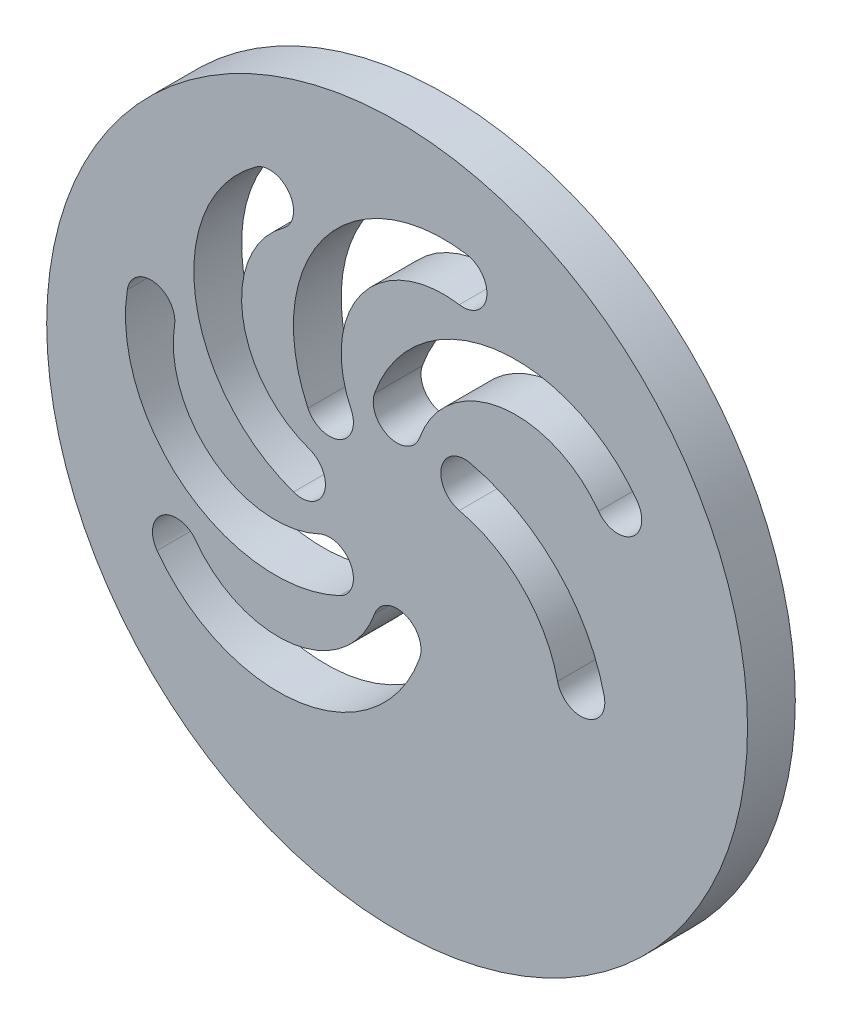
ISO-10303-21;
HEADER;
FILE_DESCRIPTION(('STEP AP214'),'2;1');
FILE_NAME('part.step','',(''),(''),'','','');
FILE_SCHEMA(('AUTOMOTIVE_DESIGN { 1 0 10303 214 1 1 1 1 }'));
ENDSEC;
DATA;
#1=APPLICATION_CONTEXT('core data for automotive mechanical design processes');
#2=APPLICATION_PROTOCOL_DEFINITION('international standard','automotive_design',2000,#1);
#3=PRODUCT_CONTEXT('',#1,'mechanical');
#4=PRODUCT('Part','Part','',(#3));
#5=PRODUCT_RELATED_PRODUCT_CATEGORY('part','',(#4));
#6=PRODUCT_DEFINITION_FORMATION('','',#4);
#7=PRODUCT_DEFINITION_CONTEXT('part definition',#1,'design');
#8=PRODUCT_DEFINITION('design','',#6,#7);
#9=PRODUCT_DEFINITION_SHAPE('','',#8);
#10=(LENGTH_UNIT() NAMED_UNIT(*) SI_UNIT(.MILLI.,.METRE.));
#11=(NAMED_UNIT(*) PLANE_ANGLE_UNIT() SI_UNIT($,.RADIAN.));
#12=(NAMED_UNIT(*) SI_UNIT($,.STERADIAN.) SOLID_ANGLE_UNIT());
#13=UNCERTAINTY_MEASURE_WITH_UNIT(LENGTH_MEASURE(1.E-05),#10,'distance_accuracy_value','');
#14=(GEOMETRIC_REPRESENTATION_CONTEXT(3) GLOBAL_UNCERTAINTY_ASSIGNED_CONTEXT((#13)) GLOBAL_UNIT_ASSIGNED_CONTEXT((#10,
#11,#12)) REPRESENTATION_CONTEXT('',''));
#15=CARTESIAN_POINT('',(0.,0.,0.));
#16=DIRECTION('',(0.,0.,1.));
#17=DIRECTION('',(1.,0.,0.));
#18=AXIS2_PLACEMENT_3D('',#15,#16,#17);
#19=CARTESIAN_POINT('',(0.,0.,4.7625));
#20=DIRECTION('',(0.,0.,1.));
#21=DIRECTION('',(1.,0.,0.));
#22=AXIS2_PLACEMENT_3D('',#19,#20,#21);
#23=PLANE('',#22);
#24=CARTESIAN_POINT('',(0.,0.,4.7625));
#25=DIRECTION('',(0.,0.,1.));
#26=DIRECTION('',(1.,0.,0.));
#27=AXIS2_PLACEMENT_3D('',#24,#25,#26);
#28=CIRCLE('',#27,34.925);
#29=CARTESIAN_POINT('',(34.925,0.,4.7625));
#30=VERTEX_POINT('',#29);
#31=EDGE_CURVE('E11',#30,#30,#28,.T.);
#32=ORIENTED_EDGE('',*,*,#31,.T.);
#33=EDGE_LOOP('',(#32));
#34=FACE_BOUND('',#33,.T.);
#35=CARTESIAN_POINT('',(21.9970452561247,12.7000000000001,4.7625));
#36=DIRECTION('',(0.,0.,1.));
#37=DIRECTION('',(-1.,0.,0.));
#38=AXIS2_PLACEMENT_3D('',#35,#36,#37);
#39=CIRCLE('',#38,2.38125);
#40=CARTESIAN_POINT('',(20.0701413644611,11.3009313973963,4.7625));
#41=VERTEX_POINT('',#40);
#42=CARTESIAN_POINT('',(23.9239491477882,14.099068602604,4.7625));
#43=VERTEX_POINT('',#42);
#44=EDGE_CURVE('E356',#41,#43,#39,.T.);
#45=ORIENTED_EDGE('',*,*,#44,.F.);
#46=CARTESIAN_POINT('',(11.834422394303,5.32121653934507,4.7625));
#47=DIRECTION('',(0.,0.,-1.));
#48=DIRECTION('',(1.,0.,0.));
#49=AXIS2_PLACEMENT_3D('',#46,#47,#48);
#50=CIRCLE('',#49,10.1776252995982);
#51=CARTESIAN_POINT('',(2.24388869657268,8.72793345328424,4.7625));
#52=VERTEX_POINT('',#51);
#53=EDGE_CURVE('E354',#52,#41,#50,.T.);
#54=ORIENTED_EDGE('',*,*,#53,.F.);
#55=CARTESIAN_POINT('',(0.,9.525,4.7625));
#56=DIRECTION('',(0.,0.,1.));
#57=DIRECTION('',(-1.,0.,0.));
#58=AXIS2_PLACEMENT_3D('',#55,#56,#57);
#59=CIRCLE('',#58,2.38125);
#60=CARTESIAN_POINT('',(-2.24388869657267,10.3220665467158,4.7625));
#61=VERTEX_POINT('',#60);
#62=EDGE_CURVE('E362',#61,#52,#59,.T.);
#63=ORIENTED_EDGE('',*,*,#62,.F.);
#64=CARTESIAN_POINT('',(11.834422394303,5.32121653934507,4.7625));
#65=DIRECTION('',(0.,0.,1.));
#66=DIRECTION('',(-1.,0.,0.));
#67=AXIS2_PLACEMENT_3D('',#64,#65,#66);
#68=CIRCLE('',#67,14.9401252995982);
#69=EDGE_CURVE('E359',#43,#61,#68,.T.);
#70=ORIENTED_EDGE('',*,*,#69,.F.);
#71=EDGE_LOOP('',(#45,#54,#63,#70));
#72=FACE_BOUND('',#71,.T.);
#73=CARTESIAN_POINT('',(-21.9970452561247,-12.7000000000001,4.7625));
#74=DIRECTION('',(0.,0.,1.));
#75=DIRECTION('',(-1.,0.,0.));
#76=AXIS2_PLACEMENT_3D('',#73,#74,#75);
#77=CIRCLE('',#76,2.38125);
#78=CARTESIAN_POINT('',(-20.0701413644611,-11.3009313973963,4.7625));
#79=VERTEX_POINT('',#78);
#80=CARTESIAN_POINT('',(-23.9239491477882,-14.099068602604,4.7625));
#81=VERTEX_POINT('',#80);
#82=EDGE_CURVE('E325',#79,#81,#77,.T.);
#83=ORIENTED_EDGE('',*,*,#82,.F.);
#84=CARTESIAN_POINT('',(-11.834422394303,-5.32121653934507,4.7625));
#85=DIRECTION('',(0.,0.,-1.));
#86=DIRECTION('',(1.,0.,0.));
#87=AXIS2_PLACEMENT_3D('',#84,#85,#86);
#88=CIRCLE('',#87,10.1776252995982);
#89=CARTESIAN_POINT('',(-2.24388869657267,-8.72793345328424,4.7625));
#90=VERTEX_POINT('',#89);
#91=EDGE_CURVE('E323',#90,#79,#88,.T.);
#92=ORIENTED_EDGE('',*,*,#91,.F.);
#93=CARTESIAN_POINT('',(0.,-9.525,4.7625));
#94=DIRECTION('',(0.,0.,1.));
#95=DIRECTION('',(-1.,0.,0.));
#96=AXIS2_PLACEMENT_3D('',#93,#94,#95);
#97=CIRCLE('',#96,2.38125);
#98=CARTESIAN_POINT('',(2.24388869657267,-10.3220665467158,4.7625));
#99=VERTEX_POINT('',#98);
#100=EDGE_CURVE('E331',#99,#90,#97,.T.);
#101=ORIENTED_EDGE('',*,*,#100,.F.);
#102=CARTESIAN_POINT('',(-11.834422394303,-5.32121653934507,4.7625));
#103=DIRECTION('',(0.,0.,1.));
#104=DIRECTION('',(-1.,0.,0.));
#105=AXIS2_PLACEMENT_3D('',#102,#103,#104);
#106=CIRCLE('',#105,14.9401252995982);
#107=EDGE_CURVE('E328',#81,#99,#106,.T.);
#108=ORIENTED_EDGE('',*,*,#107,.F.);
#109=EDGE_LOOP('',(#83,#92,#101,#108));
#110=FACE_BOUND('',#109,.T.);
#111=CARTESIAN_POINT('',(18.3186104059108,-4.9084568647241,4.7625));
#112=DIRECTION('',(0.,0.,1.));
#113=DIRECTION('',(1.,0.,0.));
#114=AXIS2_PLACEMENT_3D('',#111,#112,#113);
#115=CIRCLE('',#114,2.38125);
#116=CARTESIAN_POINT('',(15.9953090561529,-5.43058941562764,4.7625));
#117=VERTEX_POINT('',#116);
#118=CARTESIAN_POINT('',(20.6419117556687,-4.38632431382056,4.7625));
#119=VERTEX_POINT('',#118);
#120=EDGE_CURVE('E294',#117,#119,#115,.T.);
#121=ORIENTED_EDGE('',*,*,#120,.F.);
#122=CARTESIAN_POINT('',(3.2767625818453,-8.28892163977387,4.7625));
#123=DIRECTION('',(0.,0.,-1.));
#124=DIRECTION('',(1.,0.,0.));
#125=AXIS2_PLACEMENT_3D('',#122,#123,#124);
#126=CIRCLE('',#125,13.0357772120697);
#127=CARTESIAN_POINT('',(6.20101743086769,4.41462987547902,4.7625));
#128=VERTEX_POINT('',#127);
#129=EDGE_CURVE('E292',#128,#117,#126,.T.);
#130=ORIENTED_EDGE('',*,*,#129,.F.);
#131=CARTESIAN_POINT('',(6.73519209080183,6.7351920908019,4.7625));
#132=DIRECTION('',(0.,0.,1.));
#133=DIRECTION('',(-1.,0.,0.));
#134=AXIS2_PLACEMENT_3D('',#131,#132,#133);
#135=CIRCLE('',#134,2.38125);
#136=CARTESIAN_POINT('',(7.26936675073597,9.05575430612478,4.7625));
#137=VERTEX_POINT('',#136);
#138=EDGE_CURVE('E300',#137,#128,#135,.T.);
#139=ORIENTED_EDGE('',*,*,#138,.F.);
#140=CARTESIAN_POINT('',(3.2767625818453,-8.28892163977387,4.7625));
#141=DIRECTION('',(0.,0.,1.));
#142=DIRECTION('',(-1.,0.,0.));
#143=AXIS2_PLACEMENT_3D('',#140,#141,#142);
#144=CIRCLE('',#143,17.7982772120697);
#145=EDGE_CURVE('E297',#119,#137,#144,.T.);
#146=ORIENTED_EDGE('',*,*,#145,.F.);
#147=EDGE_LOOP('',(#121,#130,#139,#146));
#148=FACE_BOUND('',#147,.T.);
#149=CARTESIAN_POINT('',(-24.5345159877424,6.57400374560391,4.7625));
#150=DIRECTION('',(0.,0.,1.));
#151=DIRECTION('',(-1.,0.,0.));
#152=AXIS2_PLACEMENT_3D('',#149,#150,#151);
#153=CIRCLE('',#152,2.38125);
#154=CARTESIAN_POINT('',(-22.182698283006,6.20076783336024,4.7625));
#155=VERTEX_POINT('',#154);
#156=CARTESIAN_POINT('',(-26.8863336924788,6.94723965784758,4.7625));
#157=VERTEX_POINT('',#156);
#158=EDGE_CURVE('E263',#155,#157,#153,.T.);
#159=ORIENTED_EDGE('',*,*,#158,.F.);
#160=CARTESIAN_POINT('',(-12.1308686255705,4.60553202730468,4.7625));
#161=DIRECTION('',(0.,0.,-1.));
#162=DIRECTION('',(1.,0.,0.));
#163=AXIS2_PLACEMENT_3D('',#160,#161,#162);
#164=CIRCLE('',#163,10.1776252995982);
#165=CARTESIAN_POINT('',(-7.75824984413659,-4.58491201698783,4.7625));
#166=VERTEX_POINT('',#165);
#167=EDGE_CURVE('E261',#166,#155,#164,.T.);
#168=ORIENTED_EDGE('',*,*,#167,.F.);
#169=CARTESIAN_POINT('',(-6.73519209080187,-6.73519209080187,4.7625));
#170=DIRECTION('',(0.,0.,1.));
#171=DIRECTION('',(-1.,0.,0.));
#172=AXIS2_PLACEMENT_3D('',#169,#170,#171);
#173=CIRCLE('',#172,2.38125);
#174=CARTESIAN_POINT('',(-5.71213433746714,-8.88547216461591,4.7625));
#175=VERTEX_POINT('',#174);
#176=EDGE_CURVE('E269',#175,#166,#173,.T.);
#177=ORIENTED_EDGE('',*,*,#176,.F.);
#178=CARTESIAN_POINT('',(-12.1308686255705,4.60553202730468,4.7625));
#179=DIRECTION('',(0.,0.,1.));
#180=DIRECTION('',(-1.,0.,0.));
#181=AXIS2_PLACEMENT_3D('',#178,#179,#180);
#182=CIRCLE('',#181,14.9401252995982);
#183=EDGE_CURVE('E266',#157,#175,#182,.T.);
#184=ORIENTED_EDGE('',*,*,#183,.F.);
#185=EDGE_LOOP('',(#159,#168,#177,#184));
#186=FACE_BOUND('',#185,.T.);
#187=CARTESIAN_POINT('',(-12.7000000000001,21.9970452561247,4.7625));
#188=DIRECTION('',(0.,0.,1.));
#189=DIRECTION('',(-1.,0.,0.));
#190=AXIS2_PLACEMENT_3D('',#187,#188,#189);
#191=CIRCLE('',#190,2.38125);
#192=CARTESIAN_POINT('',(-11.3009313973963,20.0701413644611,4.7625));
#193=VERTEX_POINT('',#192);
#194=CARTESIAN_POINT('',(-14.099068602604,23.9239491477882,4.7625));
#195=VERTEX_POINT('',#194);
#196=EDGE_CURVE('E232',#193,#195,#191,.T.);
#197=ORIENTED_EDGE('',*,*,#196,.F.);
#198=CARTESIAN_POINT('',(-5.32121653934508,11.834422394303,4.7625));
#199=DIRECTION('',(0.,0.,-1.));
#200=DIRECTION('',(1.,0.,0.));
#201=AXIS2_PLACEMENT_3D('',#198,#199,#200);
#202=CIRCLE('',#201,10.1776252995982);
#203=CARTESIAN_POINT('',(-8.72793345328424,2.24388869657267,4.7625));
#204=VERTEX_POINT('',#203);
#205=EDGE_CURVE('E230',#204,#193,#202,.T.);
#206=ORIENTED_EDGE('',*,*,#205,.F.);
#207=CARTESIAN_POINT('',(-9.525,0.,4.7625));
#208=DIRECTION('',(0.,0.,1.));
#209=DIRECTION('',(-1.,0.,0.));
#210=AXIS2_PLACEMENT_3D('',#207,#208,#209);
#211=CIRCLE('',#210,2.38125);
#212=CARTESIAN_POINT('',(-10.3220665467158,-2.24388869657268,4.7625));
#213=VERTEX_POINT('',#212);
#214=EDGE_CURVE('E238',#213,#204,#211,.T.);
#215=ORIENTED_EDGE('',*,*,#214,.F.);
#216=CARTESIAN_POINT('',(-5.32121653934508,11.834422394303,4.7625));
#217=DIRECTION('',(0.,0.,1.));
#218=DIRECTION('',(-1.,0.,0.));
#219=AXIS2_PLACEMENT_3D('',#216,#217,#218);
#220=CIRCLE('',#219,14.9401252995982);
#221=EDGE_CURVE('E235',#195,#213,#220,.T.);
#222=ORIENTED_EDGE('',*,*,#221,.F.);
#223=EDGE_LOOP('',(#197,#206,#215,#222));
#224=FACE_BOUND('',#223,.T.);
#225=CARTESIAN_POINT('',(6.5740037456039,24.5345159877424,4.7625));
#226=DIRECTION('',(0.,0.,1.));
#227=DIRECTION('',(-1.,0.,0.));
#228=AXIS2_PLACEMENT_3D('',#225,#226,#227);
#229=CIRCLE('',#228,2.38125);
#230=CARTESIAN_POINT('',(6.20076783336023,22.182698283006,4.7625));
#231=VERTEX_POINT('',#230);
#232=CARTESIAN_POINT('',(6.94723965784757,26.8863336924788,4.7625));
#233=VERTEX_POINT('',#232);
#234=EDGE_CURVE('E202',#231,#233,#229,.T.);
#235=ORIENTED_EDGE('',*,*,#234,.F.);
#236=CARTESIAN_POINT('',(4.60553202730468,12.1308686255705,4.7625));
#237=DIRECTION('',(0.,0.,-1.));
#238=DIRECTION('',(1.,0.,0.));
#239=AXIS2_PLACEMENT_3D('',#236,#237,#238);
#240=CIRCLE('',#239,10.1776252995982);
#241=CARTESIAN_POINT('',(-4.58491201698783,7.75824984413659,4.7625));
#242=VERTEX_POINT('',#241);
#243=EDGE_CURVE('E194',#242,#231,#240,.T.);
#244=ORIENTED_EDGE('',*,*,#243,.F.);
#245=CARTESIAN_POINT('',(-6.73519209080187,6.73519209080186,4.7625));
#246=DIRECTION('',(0.,0.,1.));
#247=DIRECTION('',(-1.,0.,0.));
#248=AXIS2_PLACEMENT_3D('',#245,#246,#247);
#249=CIRCLE('',#248,2.38125);
#250=CARTESIAN_POINT('',(-8.88547216461591,5.71213433746714,4.7625));
#251=VERTEX_POINT('',#250);
#252=EDGE_CURVE('E216',#251,#242,#249,.T.);
#253=ORIENTED_EDGE('',*,*,#252,.F.);
#254=CARTESIAN_POINT('',(4.60553202730468,12.1308686255705,4.7625));
#255=DIRECTION('',(0.,0.,1.));
#256=DIRECTION('',(-1.,0.,0.));
#257=AXIS2_PLACEMENT_3D('',#254,#255,#256);
#258=CIRCLE('',#257,14.9401252995982);
#259=EDGE_CURVE('E214',#233,#251,#258,.T.);
#260=ORIENTED_EDGE('',*,*,#259,.F.);
#261=EDGE_LOOP('',(#235,#244,#253,#260));
#262=FACE_BOUND('',#261,.T.);
#263=ADVANCED_FACE('F33',(#34,#72,#110,#148,#186,#224,#262),#23,.T.);
#264=CARTESIAN_POINT('',(0.,0.,0.));
#265=DIRECTION('',(0.,0.,1.));
#266=DIRECTION('',(1.,0.,0.));
#267=AXIS2_PLACEMENT_3D('',#264,#265,#266);
#268=PLANE('',#267);
#269=CARTESIAN_POINT('',(-5.32121653934508,11.834422394303,0.));
#270=DIRECTION('',(0.,0.,-1.));
#271=DIRECTION('',(1.,0.,0.));
#272=AXIS2_PLACEMENT_3D('',#269,#270,#271);
#273=CIRCLE('',#272,10.1776252995982);
#274=CARTESIAN_POINT('',(-8.72793345328424,2.24388869657267,0.));
#275=VERTEX_POINT('',#274);
#276=CARTESIAN_POINT('',(-11.3009313973963,20.0701413644611,0.));
#277=VERTEX_POINT('',#276);
#278=EDGE_CURVE('E210',#275,#277,#273,.T.);
#279=ORIENTED_EDGE('',*,*,#278,.T.);
#280=CARTESIAN_POINT('',(-12.7000000000001,21.9970452561247,0.));
#281=DIRECTION('',(0.,0.,1.));
#282=DIRECTION('',(-1.,0.,0.));
#283=AXIS2_PLACEMENT_3D('',#280,#281,#282);
#284=CIRCLE('',#283,2.38125);
#285=CARTESIAN_POINT('',(-14.099068602604,23.9239491477882,0.));
#286=VERTEX_POINT('',#285);
#287=EDGE_CURVE('E243',#277,#286,#284,.T.);
#288=ORIENTED_EDGE('',*,*,#287,.T.);
#289=CARTESIAN_POINT('',(-5.32121653934508,11.834422394303,0.));
#290=DIRECTION('',(0.,0.,1.));
#291=DIRECTION('',(-1.,0.,0.));
#292=AXIS2_PLACEMENT_3D('',#289,#290,#291);
#293=CIRCLE('',#292,14.9401252995982);
#294=CARTESIAN_POINT('',(-10.3220665467158,-2.24388869657268,0.));
#295=VERTEX_POINT('',#294);
#296=EDGE_CURVE('E246',#286,#295,#293,.T.);
#297=ORIENTED_EDGE('',*,*,#296,.T.);
#298=CARTESIAN_POINT('',(-9.525,0.,0.));
#299=DIRECTION('',(0.,0.,1.));
#300=DIRECTION('',(-1.,0.,0.));
#301=AXIS2_PLACEMENT_3D('',#298,#299,#300);
#302=CIRCLE('',#301,2.38125);
#303=EDGE_CURVE('E233',#295,#275,#302,.T.);
#304=ORIENTED_EDGE('',*,*,#303,.T.);
#305=EDGE_LOOP('',(#279,#288,#297,#304));
#306=FACE_BOUND('',#305,.T.);
#307=CARTESIAN_POINT('',(3.2767625818453,-8.28892163977387,0.));
#308=DIRECTION('',(0.,0.,-1.));
#309=DIRECTION('',(1.,0.,0.));
#310=AXIS2_PLACEMENT_3D('',#307,#308,#309);
#311=CIRCLE('',#310,13.0357772120697);
#312=CARTESIAN_POINT('',(6.20101743086769,4.41462987547902,0.));
#313=VERTEX_POINT('',#312);
#314=CARTESIAN_POINT('',(15.9953090561529,-5.43058941562764,0.));
#315=VERTEX_POINT('',#314);
#316=EDGE_CURVE('E291',#313,#315,#311,.T.);
#317=ORIENTED_EDGE('',*,*,#316,.T.);
#318=CARTESIAN_POINT('',(18.3186104059108,-4.9084568647241,0.));
#319=DIRECTION('',(0.,0.,1.));
#320=DIRECTION('',(1.,0.,0.));
#321=AXIS2_PLACEMENT_3D('',#318,#319,#320);
#322=CIRCLE('',#321,2.38125);
#323=CARTESIAN_POINT('',(20.6419117556687,-4.38632431382056,0.));
#324=VERTEX_POINT('',#323);
#325=EDGE_CURVE('E305',#315,#324,#322,.T.);
#326=ORIENTED_EDGE('',*,*,#325,.T.);
#327=CARTESIAN_POINT('',(3.2767625818453,-8.28892163977387,0.));
#328=DIRECTION('',(0.,0.,1.));
#329=DIRECTION('',(-1.,0.,0.));
#330=AXIS2_PLACEMENT_3D('',#327,#328,#329);
#331=CIRCLE('',#330,17.7982772120697);
#332=CARTESIAN_POINT('',(7.26936675073597,9.05575430612478,0.));
#333=VERTEX_POINT('',#332);
#334=EDGE_CURVE('E308',#324,#333,#331,.T.);
#335=ORIENTED_EDGE('',*,*,#334,.T.);
#336=CARTESIAN_POINT('',(6.73519209080183,6.7351920908019,0.));
#337=DIRECTION('',(0.,0.,1.));
#338=DIRECTION('',(-1.,0.,0.));
#339=AXIS2_PLACEMENT_3D('',#336,#337,#338);
#340=CIRCLE('',#339,2.38125);
#341=EDGE_CURVE('E295',#333,#313,#340,.T.);
#342=ORIENTED_EDGE('',*,*,#341,.T.);
#343=EDGE_LOOP('',(#317,#326,#335,#342));
#344=FACE_BOUND('',#343,.T.);
#345=CARTESIAN_POINT('',(11.834422394303,5.32121653934507,0.));
#346=DIRECTION('',(0.,0.,-1.));
#347=DIRECTION('',(1.,0.,0.));
#348=AXIS2_PLACEMENT_3D('',#345,#346,#347);
#349=CIRCLE('',#348,10.1776252995982);
#350=CARTESIAN_POINT('',(2.24388869657267,8.72793345328424,0.));
#351=VERTEX_POINT('',#350);
#352=CARTESIAN_POINT('',(20.0701413644611,11.3009313973963,0.));
#353=VERTEX_POINT('',#352);
#354=EDGE_CURVE('E353',#351,#353,#349,.T.);
#355=ORIENTED_EDGE('',*,*,#354,.T.);
#356=CARTESIAN_POINT('',(21.9970452561247,12.7000000000001,0.));
#357=DIRECTION('',(0.,0.,1.));
#358=DIRECTION('',(-1.,0.,0.));
#359=AXIS2_PLACEMENT_3D('',#356,#357,#358);
#360=CIRCLE('',#359,2.38125);
#361=CARTESIAN_POINT('',(23.9239491477882,14.099068602604,0.));
#362=VERTEX_POINT('',#361);
#363=EDGE_CURVE('E367',#353,#362,#360,.T.);
#364=ORIENTED_EDGE('',*,*,#363,.T.);
#365=CARTESIAN_POINT('',(11.834422394303,5.32121653934507,0.));
#366=DIRECTION('',(0.,0.,1.));
#367=DIRECTION('',(-1.,0.,0.));
#368=AXIS2_PLACEMENT_3D('',#365,#366,#367);
#369=CIRCLE('',#368,14.9401252995982);
#370=CARTESIAN_POINT('',(-2.24388869657267,10.3220665467158,0.));
#371=VERTEX_POINT('',#370);
#372=EDGE_CURVE('E370',#362,#371,#369,.T.);
#373=ORIENTED_EDGE('',*,*,#372,.T.);
#374=CARTESIAN_POINT('',(0.,9.525,0.));
#375=DIRECTION('',(0.,0.,1.));
#376=DIRECTION('',(-1.,0.,0.));
#377=AXIS2_PLACEMENT_3D('',#374,#375,#376);
#378=CIRCLE('',#377,2.38125);
#379=EDGE_CURVE('E357',#371,#351,#378,.T.);
#380=ORIENTED_EDGE('',*,*,#379,.T.);
#381=EDGE_LOOP('',(#355,#364,#373,#380));
#382=FACE_BOUND('',#381,.T.);
#383=CARTESIAN_POINT('',(0.,0.,0.));
#384=DIRECTION('',(0.,0.,1.));
#385=DIRECTION('',(1.,0.,0.));
#386=AXIS2_PLACEMENT_3D('',#383,#384,#385);
#387=CIRCLE('',#386,34.925);
#388=CARTESIAN_POINT('',(34.925,0.,0.));
#389=VERTEX_POINT('',#388);
#390=EDGE_CURVE('E37',#389,#389,#387,.T.);
#391=ORIENTED_EDGE('',*,*,#390,.F.);
#392=EDGE_LOOP('',(#391));
#393=FACE_BOUND('',#392,.T.);
#394=CARTESIAN_POINT('',(-11.834422394303,-5.32121653934507,0.));
#395=DIRECTION('',(0.,0.,-1.));
#396=DIRECTION('',(1.,0.,0.));
#397=AXIS2_PLACEMENT_3D('',#394,#395,#396);
#398=CIRCLE('',#397,10.1776252995982);
#399=CARTESIAN_POINT('',(-2.24388869657267,-8.72793345328424,0.));
#400=VERTEX_POINT('',#399);
#401=CARTESIAN_POINT('',(-20.0701413644611,-11.3009313973963,0.));
#402=VERTEX_POINT('',#401);
#403=EDGE_CURVE('E322',#400,#402,#398,.T.);
#404=ORIENTED_EDGE('',*,*,#403,.T.);
#405=CARTESIAN_POINT('',(-21.9970452561247,-12.7000000000001,0.));
#406=DIRECTION('',(0.,0.,1.));
#407=DIRECTION('',(-1.,0.,0.));
#408=AXIS2_PLACEMENT_3D('',#405,#406,#407);
#409=CIRCLE('',#408,2.38125);
#410=CARTESIAN_POINT('',(-23.9239491477882,-14.099068602604,0.));
#411=VERTEX_POINT('',#410);
#412=EDGE_CURVE('E336',#402,#411,#409,.T.);
#413=ORIENTED_EDGE('',*,*,#412,.T.);
#414=CARTESIAN_POINT('',(-11.834422394303,-5.32121653934507,0.));
#415=DIRECTION('',(0.,0.,1.));
#416=DIRECTION('',(-1.,0.,0.));
#417=AXIS2_PLACEMENT_3D('',#414,#415,#416);
#418=CIRCLE('',#417,14.9401252995982);
#419=CARTESIAN_POINT('',(2.24388869657267,-10.3220665467158,0.));
#420=VERTEX_POINT('',#419);
#421=EDGE_CURVE('E339',#411,#420,#418,.T.);
#422=ORIENTED_EDGE('',*,*,#421,.T.);
#423=CARTESIAN_POINT('',(0.,-9.525,0.));
#424=DIRECTION('',(0.,0.,1.));
#425=DIRECTION('',(-1.,0.,0.));
#426=AXIS2_PLACEMENT_3D('',#423,#424,#425);
#427=CIRCLE('',#426,2.38125);
#428=EDGE_CURVE('E326',#420,#400,#427,.T.);
#429=ORIENTED_EDGE('',*,*,#428,.T.);
#430=EDGE_LOOP('',(#404,#413,#422,#429));
#431=FACE_BOUND('',#430,.T.);
#432=CARTESIAN_POINT('',(-12.1308686255705,4.60553202730468,0.));
#433=DIRECTION('',(0.,0.,-1.));
#434=DIRECTION('',(1.,0.,0.));
#435=AXIS2_PLACEMENT_3D('',#432,#433,#434);
#436=CIRCLE('',#435,10.1776252995982);
#437=CARTESIAN_POINT('',(-7.75824984413659,-4.58491201698783,0.));
#438=VERTEX_POINT('',#437);
#439=CARTESIAN_POINT('',(-22.182698283006,6.20076783336024,0.));
#440=VERTEX_POINT('',#439);
#441=EDGE_CURVE('E260',#438,#440,#436,.T.);
#442=ORIENTED_EDGE('',*,*,#441,.T.);
#443=CARTESIAN_POINT('',(-24.5345159877424,6.57400374560391,0.));
#444=DIRECTION('',(0.,0.,1.));
#445=DIRECTION('',(-1.,0.,0.));
#446=AXIS2_PLACEMENT_3D('',#443,#444,#445);
#447=CIRCLE('',#446,2.38125);
#448=CARTESIAN_POINT('',(-26.8863336924788,6.94723965784758,0.));
#449=VERTEX_POINT('',#448);
#450=EDGE_CURVE('E274',#440,#449,#447,.T.);
#451=ORIENTED_EDGE('',*,*,#450,.T.);
#452=CARTESIAN_POINT('',(-12.1308686255705,4.60553202730468,0.));
#453=DIRECTION('',(0.,0.,1.));
#454=DIRECTION('',(-1.,0.,0.));
#455=AXIS2_PLACEMENT_3D('',#452,#453,#454);
#456=CIRCLE('',#455,14.9401252995982);
#457=CARTESIAN_POINT('',(-5.71213433746714,-8.88547216461591,0.));
#458=VERTEX_POINT('',#457);
#459=EDGE_CURVE('E277',#449,#458,#456,.T.);
#460=ORIENTED_EDGE('',*,*,#459,.T.);
#461=CARTESIAN_POINT('',(-6.73519209080187,-6.73519209080187,0.));
#462=DIRECTION('',(0.,0.,1.));
#463=DIRECTION('',(-1.,0.,0.));
#464=AXIS2_PLACEMENT_3D('',#461,#462,#463);
#465=CIRCLE('',#464,2.38125);
#466=EDGE_CURVE('E264',#458,#438,#465,.T.);
#467=ORIENTED_EDGE('',*,*,#466,.T.);
#468=EDGE_LOOP('',(#442,#451,#460,#467));
#469=FACE_BOUND('',#468,.T.);
#470=CARTESIAN_POINT('',(4.60553202730468,12.1308686255705,0.));
#471=DIRECTION('',(0.,0.,-1.));
#472=DIRECTION('',(1.,0.,0.));
#473=AXIS2_PLACEMENT_3D('',#470,#471,#472);
#474=CIRCLE('',#473,10.1776252995982);
#475=CARTESIAN_POINT('',(-4.58491201698783,7.75824984413659,0.));
#476=VERTEX_POINT('',#475);
#477=CARTESIAN_POINT('',(6.20076783336023,22.182698283006,0.));
#478=VERTEX_POINT('',#477);
#479=EDGE_CURVE('E56',#476,#478,#474,.T.);
#480=ORIENTED_EDGE('',*,*,#479,.T.);
#481=CARTESIAN_POINT('',(6.5740037456039,24.5345159877424,0.));
#482=DIRECTION('',(0.,0.,1.));
#483=DIRECTION('',(-1.,0.,0.));
#484=AXIS2_PLACEMENT_3D('',#481,#482,#483);
#485=CIRCLE('',#484,2.38125);
#486=CARTESIAN_POINT('',(6.94723965784757,26.8863336924788,0.));
#487=VERTEX_POINT('',#486);
#488=EDGE_CURVE('E209',#478,#487,#485,.T.);
#489=ORIENTED_EDGE('',*,*,#488,.T.);
#490=CARTESIAN_POINT('',(4.60553202730468,12.1308686255705,0.));
#491=DIRECTION('',(0.,0.,1.));
#492=DIRECTION('',(-1.,0.,0.));
#493=AXIS2_PLACEMENT_3D('',#490,#491,#492);
#494=CIRCLE('',#493,14.9401252995982);
#495=CARTESIAN_POINT('',(-8.88547216461591,5.71213433746714,0.));
#496=VERTEX_POINT('',#495);
#497=EDGE_CURVE('E222',#487,#496,#494,.T.);
#498=ORIENTED_EDGE('',*,*,#497,.T.);
#499=CARTESIAN_POINT('',(-6.73519209080187,6.73519209080186,0.));
#500=DIRECTION('',(0.,0.,1.));
#501=DIRECTION('',(-1.,0.,0.));
#502=AXIS2_PLACEMENT_3D('',#499,#500,#501);
#503=CIRCLE('',#502,2.38125);
#504=EDGE_CURVE('E203',#496,#476,#503,.T.);
#505=ORIENTED_EDGE('',*,*,#504,.T.);
#506=EDGE_LOOP('',(#480,#489,#498,#505));
#507=FACE_BOUND('',#506,.T.);
#508=ADVANCED_FACE('F389',(#306,#344,#382,#393,#431,#469,#507),#268,.F.);
#509=CARTESIAN_POINT('',(0.,0.,4.7625));
#510=DIRECTION('',(0.,0.,-1.));
#511=DIRECTION('',(-1.,0.,0.));
#512=AXIS2_PLACEMENT_3D('',#509,#510,#511);
#513=CYLINDRICAL_SURFACE('',#512,34.925);
#514=ORIENTED_EDGE('',*,*,#31,.F.);
#515=EDGE_LOOP('',(#514));
#516=FACE_BOUND('',#515,.T.);
#517=ORIENTED_EDGE('',*,*,#390,.T.);
#518=EDGE_LOOP('',(#517));
#519=FACE_BOUND('',#518,.T.);
#520=ADVANCED_FACE('F35',(#516,#519),#513,.T.);
#521=CARTESIAN_POINT('',(11.834422394303,5.32121653934507,4.7625));
#522=DIRECTION('',(0.,0.,-1.));
#523=DIRECTION('',(-1.,0.,0.));
#524=AXIS2_PLACEMENT_3D('',#521,#522,#523);
#525=CYLINDRICAL_SURFACE('',#524,10.1776252995982);
#526=ORIENTED_EDGE('',*,*,#354,.F.);
#527=DIRECTION('',(0.,0.,-1.));
#528=VECTOR('',#527,1.);
#529=CARTESIAN_POINT('',(2.24388869657268,8.72793345328424,4.7625));
#530=LINE('',#529,#528);
#531=EDGE_CURVE('E364',#52,#351,#530,.T.);
#532=ORIENTED_EDGE('',*,*,#531,.F.);
#533=ORIENTED_EDGE('',*,*,#53,.T.);
#534=DIRECTION('',(0.,0.,-1.));
#535=VECTOR('',#534,1.);
#536=CARTESIAN_POINT('',(20.0701413644611,11.3009313973963,4.7625));
#537=LINE('',#536,#535);
#538=EDGE_CURVE('E381',#41,#353,#537,.T.);
#539=ORIENTED_EDGE('',*,*,#538,.T.);
#540=EDGE_LOOP('',(#526,#532,#533,#539));
#541=FACE_BOUND('',#540,.T.);
#542=ADVANCED_FACE('F412',(#541),#525,.T.);
#543=CARTESIAN_POINT('',(21.9970452561247,12.7000000000001,4.7625));
#544=DIRECTION('',(0.,0.,-1.));
#545=DIRECTION('',(-1.,0.,0.));
#546=AXIS2_PLACEMENT_3D('',#543,#544,#545);
#547=CYLINDRICAL_SURFACE('',#546,2.38125);
#548=ORIENTED_EDGE('',*,*,#363,.F.);
#549=ORIENTED_EDGE('',*,*,#538,.F.);
#550=ORIENTED_EDGE('',*,*,#44,.T.);
#551=DIRECTION('',(0.,0.,-1.));
#552=VECTOR('',#551,1.);
#553=CARTESIAN_POINT('',(23.9239491477882,14.099068602604,4.7625));
#554=LINE('',#553,#552);
#555=EDGE_CURVE('E379',#43,#362,#554,.T.);
#556=ORIENTED_EDGE('',*,*,#555,.T.);
#557=EDGE_LOOP('',(#548,#549,#550,#556));
#558=FACE_BOUND('',#557,.T.);
#559=ADVANCED_FACE('F415',(#558),#547,.F.);
#560=CARTESIAN_POINT('',(11.834422394303,5.32121653934507,4.7625));
#561=DIRECTION('',(0.,0.,-1.));
#562=DIRECTION('',(-1.,0.,0.));
#563=AXIS2_PLACEMENT_3D('',#560,#561,#562);
#564=CYLINDRICAL_SURFACE('',#563,14.9401252995982);
#565=ORIENTED_EDGE('',*,*,#372,.F.);
#566=ORIENTED_EDGE('',*,*,#555,.F.);
#567=ORIENTED_EDGE('',*,*,#69,.T.);
#568=DIRECTION('',(0.,0.,-1.));
#569=VECTOR('',#568,1.);
#570=CARTESIAN_POINT('',(-2.24388869657267,10.3220665467158,4.7625));
#571=LINE('',#570,#569);
#572=EDGE_CURVE('E377',#61,#371,#571,.T.);
#573=ORIENTED_EDGE('',*,*,#572,.T.);
#574=EDGE_LOOP('',(#565,#566,#567,#573));
#575=FACE_BOUND('',#574,.T.);
#576=ADVANCED_FACE('F418',(#575),#564,.F.);
#577=CARTESIAN_POINT('',(0.,9.525,4.7625));
#578=DIRECTION('',(0.,0.,-1.));
#579=DIRECTION('',(-1.,0.,0.));
#580=AXIS2_PLACEMENT_3D('',#577,#578,#579);
#581=CYLINDRICAL_SURFACE('',#580,2.38125);
#582=ORIENTED_EDGE('',*,*,#379,.F.);
#583=ORIENTED_EDGE('',*,*,#572,.F.);
#584=ORIENTED_EDGE('',*,*,#62,.T.);
#585=ORIENTED_EDGE('',*,*,#531,.T.);
#586=EDGE_LOOP('',(#582,#583,#584,#585));
#587=FACE_BOUND('',#586,.T.);
#588=ADVANCED_FACE('F422',(#587),#581,.F.);
#589=CARTESIAN_POINT('',(-11.834422394303,-5.32121653934507,4.7625));
#590=DIRECTION('',(0.,0.,-1.));
#591=DIRECTION('',(-1.,0.,0.));
#592=AXIS2_PLACEMENT_3D('',#589,#590,#591);
#593=CYLINDRICAL_SURFACE('',#592,10.1776252995982);
#594=ORIENTED_EDGE('',*,*,#403,.F.);
#595=DIRECTION('',(0.,0.,-1.));
#596=VECTOR('',#595,1.);
#597=CARTESIAN_POINT('',(-2.24388869657267,-8.72793345328424,4.7625));
#598=LINE('',#597,#596);
#599=EDGE_CURVE('E333',#90,#400,#598,.T.);
#600=ORIENTED_EDGE('',*,*,#599,.F.);
#601=ORIENTED_EDGE('',*,*,#91,.T.);
#602=DIRECTION('',(0.,0.,-1.));
#603=VECTOR('',#602,1.);
#604=CARTESIAN_POINT('',(-20.0701413644611,-11.3009313973963,4.7625));
#605=LINE('',#604,#603);
#606=EDGE_CURVE('E350',#79,#402,#605,.T.);
#607=ORIENTED_EDGE('',*,*,#606,.T.);
#608=EDGE_LOOP('',(#594,#600,#601,#607));
#609=FACE_BOUND('',#608,.T.);
#610=ADVANCED_FACE('F426',(#609),#593,.T.);
#611=CARTESIAN_POINT('',(-21.9970452561247,-12.7000000000001,4.7625));
#612=DIRECTION('',(0.,0.,-1.));
#613=DIRECTION('',(-1.,0.,0.));
#614=AXIS2_PLACEMENT_3D('',#611,#612,#613);
#615=CYLINDRICAL_SURFACE('',#614,2.38125);
#616=ORIENTED_EDGE('',*,*,#412,.F.);
#617=ORIENTED_EDGE('',*,*,#606,.F.);
#618=ORIENTED_EDGE('',*,*,#82,.T.);
#619=DIRECTION('',(0.,0.,-1.));
#620=VECTOR('',#619,1.);
#621=CARTESIAN_POINT('',(-23.9239491477882,-14.099068602604,4.7625));
#622=LINE('',#621,#620);
#623=EDGE_CURVE('E348',#81,#411,#622,.T.);
#624=ORIENTED_EDGE('',*,*,#623,.T.);
#625=EDGE_LOOP('',(#616,#617,#618,#624));
#626=FACE_BOUND('',#625,.T.);
#627=ADVANCED_FACE('F430',(#626),#615,.F.);
#628=CARTESIAN_POINT('',(-11.834422394303,-5.32121653934507,4.7625));
#629=DIRECTION('',(0.,0.,-1.));
#630=DIRECTION('',(-1.,0.,0.));
#631=AXIS2_PLACEMENT_3D('',#628,#629,#630);
#632=CYLINDRICAL_SURFACE('',#631,14.9401252995982);
#633=ORIENTED_EDGE('',*,*,#421,.F.);
#634=ORIENTED_EDGE('',*,*,#623,.F.);
#635=ORIENTED_EDGE('',*,*,#107,.T.);
#636=DIRECTION('',(0.,0.,-1.));
#637=VECTOR('',#636,1.);
#638=CARTESIAN_POINT('',(2.24388869657267,-10.3220665467158,4.7625));
#639=LINE('',#638,#637);
#640=EDGE_CURVE('E346',#99,#420,#639,.T.);
#641=ORIENTED_EDGE('',*,*,#640,.T.);
#642=EDGE_LOOP('',(#633,#634,#635,#641));
#643=FACE_BOUND('',#642,.T.);
#644=ADVANCED_FACE('F434',(#643),#632,.F.);
#645=CARTESIAN_POINT('',(0.,-9.525,4.7625));
#646=DIRECTION('',(0.,0.,-1.));
#647=DIRECTION('',(-1.,0.,0.));
#648=AXIS2_PLACEMENT_3D('',#645,#646,#647);
#649=CYLINDRICAL_SURFACE('',#648,2.38125);
#650=ORIENTED_EDGE('',*,*,#428,.F.);
#651=ORIENTED_EDGE('',*,*,#640,.F.);
#652=ORIENTED_EDGE('',*,*,#100,.T.);
#653=ORIENTED_EDGE('',*,*,#599,.T.);
#654=EDGE_LOOP('',(#650,#651,#652,#653));
#655=FACE_BOUND('',#654,.T.);
#656=ADVANCED_FACE('F438',(#655),#649,.F.);
#657=CARTESIAN_POINT('',(3.2767625818453,-8.28892163977387,4.7625));
#658=DIRECTION('',(0.,0.,-1.));
#659=DIRECTION('',(-1.,0.,0.));
#660=AXIS2_PLACEMENT_3D('',#657,#658,#659);
#661=CYLINDRICAL_SURFACE('',#660,13.0357772120697);
#662=ORIENTED_EDGE('',*,*,#316,.F.);
#663=DIRECTION('',(0.,0.,-1.));
#664=VECTOR('',#663,1.);
#665=CARTESIAN_POINT('',(6.20101743086769,4.41462987547902,4.7625));
#666=LINE('',#665,#664);
#667=EDGE_CURVE('E302',#128,#313,#666,.T.);
#668=ORIENTED_EDGE('',*,*,#667,.F.);
#669=ORIENTED_EDGE('',*,*,#129,.T.);
#670=DIRECTION('',(0.,0.,-1.));
#671=VECTOR('',#670,1.);
#672=CARTESIAN_POINT('',(15.9953090561529,-5.43058941562764,4.7625));
#673=LINE('',#672,#671);
#674=EDGE_CURVE('E319',#117,#315,#673,.T.);
#675=ORIENTED_EDGE('',*,*,#674,.T.);
#676=EDGE_LOOP('',(#662,#668,#669,#675));
#677=FACE_BOUND('',#676,.T.);
#678=ADVANCED_FACE('F442',(#677),#661,.T.);
#679=CARTESIAN_POINT('',(18.3186104059108,-4.9084568647241,4.7625));
#680=DIRECTION('',(0.,0.,-1.));
#681=DIRECTION('',(-1.,0.,0.));
#682=AXIS2_PLACEMENT_3D('',#679,#680,#681);
#683=CYLINDRICAL_SURFACE('',#682,2.38125);
#684=ORIENTED_EDGE('',*,*,#325,.F.);
#685=ORIENTED_EDGE('',*,*,#674,.F.);
#686=ORIENTED_EDGE('',*,*,#120,.T.);
#687=DIRECTION('',(0.,0.,-1.));
#688=VECTOR('',#687,1.);
#689=CARTESIAN_POINT('',(20.6419117556687,-4.38632431382056,4.7625));
#690=LINE('',#689,#688);
#691=EDGE_CURVE('E317',#119,#324,#690,.T.);
#692=ORIENTED_EDGE('',*,*,#691,.T.);
#693=EDGE_LOOP('',(#684,#685,#686,#692));
#694=FACE_BOUND('',#693,.T.);
#695=ADVANCED_FACE('F446',(#694),#683,.F.);
#696=CARTESIAN_POINT('',(3.2767625818453,-8.28892163977387,4.7625));
#697=DIRECTION('',(0.,0.,-1.));
#698=DIRECTION('',(-1.,0.,0.));
#699=AXIS2_PLACEMENT_3D('',#696,#697,#698);
#700=CYLINDRICAL_SURFACE('',#699,17.7982772120697);
#701=ORIENTED_EDGE('',*,*,#334,.F.);
#702=ORIENTED_EDGE('',*,*,#691,.F.);
#703=ORIENTED_EDGE('',*,*,#145,.T.);
#704=DIRECTION('',(0.,0.,-1.));
#705=VECTOR('',#704,1.);
#706=CARTESIAN_POINT('',(7.26936675073597,9.05575430612478,4.7625));
#707=LINE('',#706,#705);
#708=EDGE_CURVE('E315',#137,#333,#707,.T.);
#709=ORIENTED_EDGE('',*,*,#708,.T.);
#710=EDGE_LOOP('',(#701,#702,#703,#709));
#711=FACE_BOUND('',#710,.T.);
#712=ADVANCED_FACE('F450',(#711),#700,.F.);
#713=CARTESIAN_POINT('',(6.73519209080183,6.7351920908019,4.7625));
#714=DIRECTION('',(0.,0.,-1.));
#715=DIRECTION('',(-1.,0.,0.));
#716=AXIS2_PLACEMENT_3D('',#713,#714,#715);
#717=CYLINDRICAL_SURFACE('',#716,2.38125);
#718=ORIENTED_EDGE('',*,*,#341,.F.);
#719=ORIENTED_EDGE('',*,*,#708,.F.);
#720=ORIENTED_EDGE('',*,*,#138,.T.);
#721=ORIENTED_EDGE('',*,*,#667,.T.);
#722=EDGE_LOOP('',(#718,#719,#720,#721));
#723=FACE_BOUND('',#722,.T.);
#724=ADVANCED_FACE('F454',(#723),#717,.F.);
#725=CARTESIAN_POINT('',(-12.1308686255705,4.60553202730468,4.7625));
#726=DIRECTION('',(0.,0.,-1.));
#727=DIRECTION('',(-1.,0.,0.));
#728=AXIS2_PLACEMENT_3D('',#725,#726,#727);
#729=CYLINDRICAL_SURFACE('',#728,10.1776252995982);
#730=ORIENTED_EDGE('',*,*,#441,.F.);
#731=DIRECTION('',(0.,0.,-1.));
#732=VECTOR('',#731,1.);
#733=CARTESIAN_POINT('',(-7.75824984413659,-4.58491201698783,4.7625));
#734=LINE('',#733,#732);
#735=EDGE_CURVE('E271',#166,#438,#734,.T.);
#736=ORIENTED_EDGE('',*,*,#735,.F.);
#737=ORIENTED_EDGE('',*,*,#167,.T.);
#738=DIRECTION('',(0.,0.,-1.));
#739=VECTOR('',#738,1.);
#740=CARTESIAN_POINT('',(-22.182698283006,6.20076783336024,4.7625));
#741=LINE('',#740,#739);
#742=EDGE_CURVE('E288',#155,#440,#741,.T.);
#743=ORIENTED_EDGE('',*,*,#742,.T.);
#744=EDGE_LOOP('',(#730,#736,#737,#743));
#745=FACE_BOUND('',#744,.T.);
#746=ADVANCED_FACE('F458',(#745),#729,.T.);
#747=CARTESIAN_POINT('',(-24.5345159877424,6.57400374560391,4.7625));
#748=DIRECTION('',(0.,0.,-1.));
#749=DIRECTION('',(-1.,0.,0.));
#750=AXIS2_PLACEMENT_3D('',#747,#748,#749);
#751=CYLINDRICAL_SURFACE('',#750,2.38125);
#752=ORIENTED_EDGE('',*,*,#450,.F.);
#753=ORIENTED_EDGE('',*,*,#742,.F.);
#754=ORIENTED_EDGE('',*,*,#158,.T.);
#755=DIRECTION('',(0.,0.,-1.));
#756=VECTOR('',#755,1.);
#757=CARTESIAN_POINT('',(-26.8863336924788,6.94723965784758,4.7625));
#758=LINE('',#757,#756);
#759=EDGE_CURVE('E286',#157,#449,#758,.T.);
#760=ORIENTED_EDGE('',*,*,#759,.T.);
#761=EDGE_LOOP('',(#752,#753,#754,#760));
#762=FACE_BOUND('',#761,.T.);
#763=ADVANCED_FACE('F462',(#762),#751,.F.);
#764=CARTESIAN_POINT('',(-12.1308686255705,4.60553202730468,4.7625));
#765=DIRECTION('',(0.,0.,-1.));
#766=DIRECTION('',(-1.,0.,0.));
#767=AXIS2_PLACEMENT_3D('',#764,#765,#766);
#768=CYLINDRICAL_SURFACE('',#767,14.9401252995982);
#769=ORIENTED_EDGE('',*,*,#459,.F.);
#770=ORIENTED_EDGE('',*,*,#759,.F.);
#771=ORIENTED_EDGE('',*,*,#183,.T.);
#772=DIRECTION('',(0.,0.,-1.));
#773=VECTOR('',#772,1.);
#774=CARTESIAN_POINT('',(-5.71213433746714,-8.88547216461591,4.7625));
#775=LINE('',#774,#773);
#776=EDGE_CURVE('E284',#175,#458,#775,.T.);
#777=ORIENTED_EDGE('',*,*,#776,.T.);
#778=EDGE_LOOP('',(#769,#770,#771,#777));
#779=FACE_BOUND('',#778,.T.);
#780=ADVANCED_FACE('F466',(#779),#768,.F.);
#781=CARTESIAN_POINT('',(-6.73519209080187,-6.73519209080187,4.7625));
#782=DIRECTION('',(0.,0.,-1.));
#783=DIRECTION('',(-1.,0.,0.));
#784=AXIS2_PLACEMENT_3D('',#781,#782,#783);
#785=CYLINDRICAL_SURFACE('',#784,2.38125);
#786=ORIENTED_EDGE('',*,*,#466,.F.);
#787=ORIENTED_EDGE('',*,*,#776,.F.);
#788=ORIENTED_EDGE('',*,*,#176,.T.);
#789=ORIENTED_EDGE('',*,*,#735,.T.);
#790=EDGE_LOOP('',(#786,#787,#788,#789));
#791=FACE_BOUND('',#790,.T.);
#792=ADVANCED_FACE('F470',(#791),#785,.F.);
#793=CARTESIAN_POINT('',(-5.32121653934508,11.834422394303,4.7625));
#794=DIRECTION('',(0.,0.,-1.));
#795=DIRECTION('',(-1.,0.,0.));
#796=AXIS2_PLACEMENT_3D('',#793,#794,#795);
#797=CYLINDRICAL_SURFACE('',#796,10.1776252995982);
#798=ORIENTED_EDGE('',*,*,#278,.F.);
#799=DIRECTION('',(0.,0.,-1.));
#800=VECTOR('',#799,1.);
#801=CARTESIAN_POINT('',(-8.72793345328424,2.24388869657267,4.7625));
#802=LINE('',#801,#800);
#803=EDGE_CURVE('E240',#204,#275,#802,.T.);
#804=ORIENTED_EDGE('',*,*,#803,.F.);
#805=ORIENTED_EDGE('',*,*,#205,.T.);
#806=DIRECTION('',(0.,0.,-1.));
#807=VECTOR('',#806,1.);
#808=CARTESIAN_POINT('',(-11.3009313973963,20.0701413644611,4.7625));
#809=LINE('',#808,#807);
#810=EDGE_CURVE('E257',#193,#277,#809,.T.);
#811=ORIENTED_EDGE('',*,*,#810,.T.);
#812=EDGE_LOOP('',(#798,#804,#805,#811));
#813=FACE_BOUND('',#812,.T.);
#814=ADVANCED_FACE('F474',(#813),#797,.T.);
#815=CARTESIAN_POINT('',(-12.7000000000001,21.9970452561247,4.7625));
#816=DIRECTION('',(0.,0.,-1.));
#817=DIRECTION('',(-1.,0.,0.));
#818=AXIS2_PLACEMENT_3D('',#815,#816,#817);
#819=CYLINDRICAL_SURFACE('',#818,2.38125);
#820=ORIENTED_EDGE('',*,*,#287,.F.);
#821=ORIENTED_EDGE('',*,*,#810,.F.);
#822=ORIENTED_EDGE('',*,*,#196,.T.);
#823=DIRECTION('',(0.,0.,-1.));
#824=VECTOR('',#823,1.);
#825=CARTESIAN_POINT('',(-14.099068602604,23.9239491477882,4.7625));
#826=LINE('',#825,#824);
#827=EDGE_CURVE('E255',#195,#286,#826,.T.);
#828=ORIENTED_EDGE('',*,*,#827,.T.);
#829=EDGE_LOOP('',(#820,#821,#822,#828));
#830=FACE_BOUND('',#829,.T.);
#831=ADVANCED_FACE('F478',(#830),#819,.F.);
#832=CARTESIAN_POINT('',(-5.32121653934508,11.834422394303,4.7625));
#833=DIRECTION('',(0.,0.,-1.));
#834=DIRECTION('',(-1.,0.,0.));
#835=AXIS2_PLACEMENT_3D('',#832,#833,#834);
#836=CYLINDRICAL_SURFACE('',#835,14.9401252995982);
#837=ORIENTED_EDGE('',*,*,#296,.F.);
#838=ORIENTED_EDGE('',*,*,#827,.F.);
#839=ORIENTED_EDGE('',*,*,#221,.T.);
#840=DIRECTION('',(0.,0.,-1.));
#841=VECTOR('',#840,1.);
#842=CARTESIAN_POINT('',(-10.3220665467158,-2.24388869657268,4.7625));
#843=LINE('',#842,#841);
#844=EDGE_CURVE('E253',#213,#295,#843,.T.);
#845=ORIENTED_EDGE('',*,*,#844,.T.);
#846=EDGE_LOOP('',(#837,#838,#839,#845));
#847=FACE_BOUND('',#846,.T.);
#848=ADVANCED_FACE('F482',(#847),#836,.F.);
#849=CARTESIAN_POINT('',(-9.525,0.,4.7625));
#850=DIRECTION('',(0.,0.,-1.));
#851=DIRECTION('',(-1.,0.,0.));
#852=AXIS2_PLACEMENT_3D('',#849,#850,#851);
#853=CYLINDRICAL_SURFACE('',#852,2.38125);
#854=ORIENTED_EDGE('',*,*,#303,.F.);
#855=ORIENTED_EDGE('',*,*,#844,.F.);
#856=ORIENTED_EDGE('',*,*,#214,.T.);
#857=ORIENTED_EDGE('',*,*,#803,.T.);
#858=EDGE_LOOP('',(#854,#855,#856,#857));
#859=FACE_BOUND('',#858,.T.);
#860=ADVANCED_FACE('F486',(#859),#853,.F.);
#861=CARTESIAN_POINT('',(4.60553202730468,12.1308686255705,4.7625));
#862=DIRECTION('',(0.,0.,-1.));
#863=DIRECTION('',(-1.,0.,0.));
#864=AXIS2_PLACEMENT_3D('',#861,#862,#863);
#865=CYLINDRICAL_SURFACE('',#864,10.1776252995982);
#866=ORIENTED_EDGE('',*,*,#479,.F.);
#867=DIRECTION('',(0.,0.,-1.));
#868=VECTOR('',#867,1.);
#869=CARTESIAN_POINT('',(-4.58491201698783,7.75824984413659,4.7625));
#870=LINE('',#869,#868);
#871=EDGE_CURVE('E198',#242,#476,#870,.T.);
#872=ORIENTED_EDGE('',*,*,#871,.F.);
#873=ORIENTED_EDGE('',*,*,#243,.T.);
#874=DIRECTION('',(0.,0.,-1.));
#875=VECTOR('',#874,1.);
#876=CARTESIAN_POINT('',(6.20076783336023,22.182698283006,4.7625));
#877=LINE('',#876,#875);
#878=EDGE_CURVE('E197',#231,#478,#877,.T.);
#879=ORIENTED_EDGE('',*,*,#878,.T.);
#880=EDGE_LOOP('',(#866,#872,#873,#879));
#881=FACE_BOUND('',#880,.T.);
#882=ADVANCED_FACE('F196',(#881),#865,.T.);
#883=CARTESIAN_POINT('',(6.5740037456039,24.5345159877424,4.7625));
#884=DIRECTION('',(0.,0.,-1.));
#885=DIRECTION('',(-1.,0.,0.));
#886=AXIS2_PLACEMENT_3D('',#883,#884,#885);
#887=CYLINDRICAL_SURFACE('',#886,2.38125);
#888=ORIENTED_EDGE('',*,*,#488,.F.);
#889=ORIENTED_EDGE('',*,*,#878,.F.);
#890=ORIENTED_EDGE('',*,*,#234,.T.);
#891=DIRECTION('',(0.,0.,-1.));
#892=VECTOR('',#891,1.);
#893=CARTESIAN_POINT('',(6.94723965784757,26.8863336924788,4.7625));
#894=LINE('',#893,#892);
#895=EDGE_CURVE('E211',#233,#487,#894,.T.);
#896=ORIENTED_EDGE('',*,*,#895,.T.);
#897=EDGE_LOOP('',(#888,#889,#890,#896));
#898=FACE_BOUND('',#897,.T.);
#899=ADVANCED_FACE('F206',(#898),#887,.F.);
#900=CARTESIAN_POINT('',(4.60553202730468,12.1308686255705,4.7625));
#901=DIRECTION('',(0.,0.,-1.));
#902=DIRECTION('',(-1.,0.,0.));
#903=AXIS2_PLACEMENT_3D('',#900,#901,#902);
#904=CYLINDRICAL_SURFACE('',#903,14.9401252995982);
#905=ORIENTED_EDGE('',*,*,#497,.F.);
#906=ORIENTED_EDGE('',*,*,#895,.F.);
#907=ORIENTED_EDGE('',*,*,#259,.T.);
#908=DIRECTION('',(0.,0.,-1.));
#909=VECTOR('',#908,1.);
#910=CARTESIAN_POINT('',(-8.88547216461591,5.71213433746714,4.7625));
#911=LINE('',#910,#909);
#912=EDGE_CURVE('E48',#251,#496,#911,.T.);
#913=ORIENTED_EDGE('',*,*,#912,.T.);
#914=EDGE_LOOP('',(#905,#906,#907,#913));
#915=FACE_BOUND('',#914,.T.);
#916=ADVANCED_FACE('F398',(#915),#904,.F.);
#917=CARTESIAN_POINT('',(-6.73519209080187,6.73519209080186,4.7625));
#918=DIRECTION('',(0.,0.,-1.));
#919=DIRECTION('',(-1.,0.,0.));
#920=AXIS2_PLACEMENT_3D('',#917,#918,#919);
#921=CYLINDRICAL_SURFACE('',#920,2.38125);
#922=ORIENTED_EDGE('',*,*,#504,.F.);
#923=ORIENTED_EDGE('',*,*,#912,.F.);
#924=ORIENTED_EDGE('',*,*,#252,.T.);
#925=ORIENTED_EDGE('',*,*,#871,.T.);
#926=EDGE_LOOP('',(#922,#923,#924,#925));
#927=FACE_BOUND('',#926,.T.);
#928=ADVANCED_FACE('F396',(#927),#921,.F.);
#929=CLOSED_SHELL('',(#263,#508,#520,#542,#559,#576,#588,#610,#627,#644,#656,#678,#695,#712,
#724,#746,#763,#780,#792,#814,#831,#848,#860,#882,#899,#916,#928));
#930=MANIFOLD_SOLID_BREP('B2',#929);
#931=ADVANCED_BREP_SHAPE_REPRESENTATION('',(#18,#930),#14);
#932=SHAPE_DEFINITION_REPRESENTATION(#9,#931);
ENDSEC;
END-ISO-10303-21;
